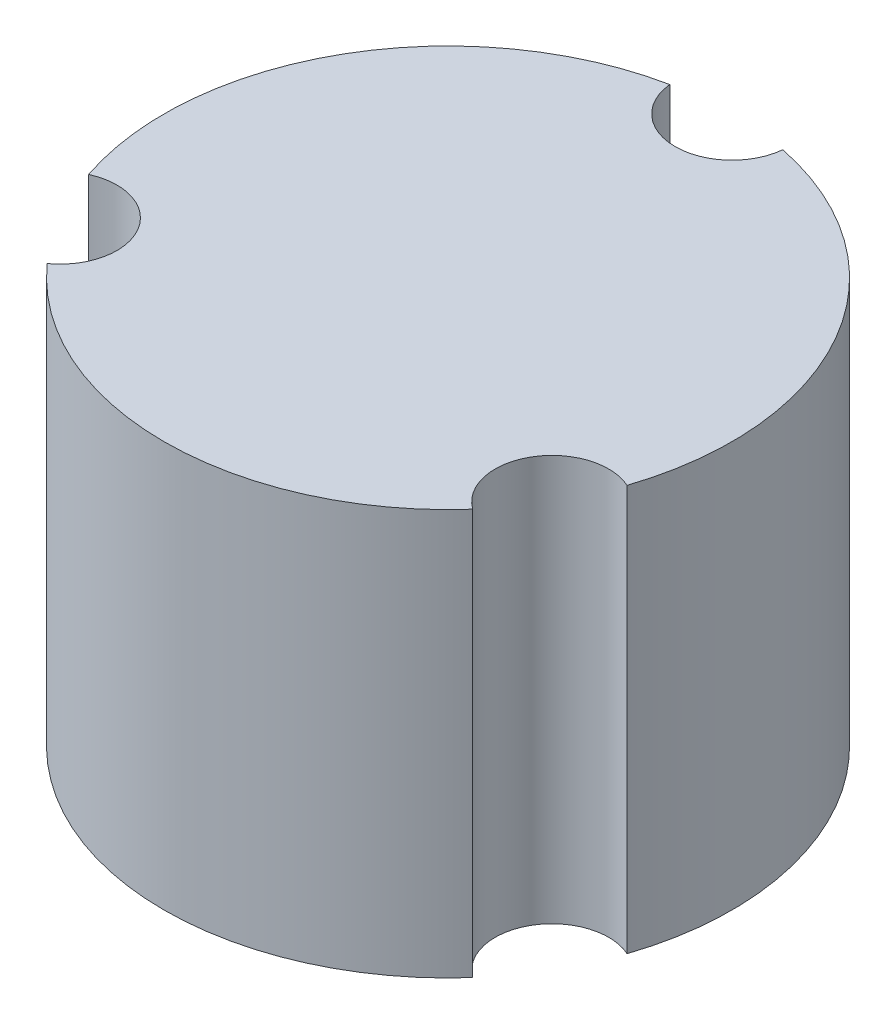
ISO-10303-21;
HEADER;
FILE_DESCRIPTION(('STEP AP214'),'2;1');
FILE_NAME('part.step','',(''),(''),'','','');
FILE_SCHEMA(('AUTOMOTIVE_DESIGN { 1 0 10303 214 1 1 1 1 }'));
ENDSEC;
DATA;
#1=APPLICATION_CONTEXT('core data for automotive mechanical design processes');
#2=APPLICATION_PROTOCOL_DEFINITION('international standard','automotive_design',2000,#1);
#3=PRODUCT_CONTEXT('',#1,'mechanical');
#4=PRODUCT('Part','Part','',(#3));
#5=PRODUCT_RELATED_PRODUCT_CATEGORY('part','',(#4));
#6=PRODUCT_DEFINITION_FORMATION('','',#4);
#7=PRODUCT_DEFINITION_CONTEXT('part definition',#1,'design');
#8=PRODUCT_DEFINITION('design','',#6,#7);
#9=PRODUCT_DEFINITION_SHAPE('','',#8);
#10=(LENGTH_UNIT() NAMED_UNIT(*) SI_UNIT(.MILLI.,.METRE.));
#11=(NAMED_UNIT(*) PLANE_ANGLE_UNIT() SI_UNIT($,.RADIAN.));
#12=(NAMED_UNIT(*) SI_UNIT($,.STERADIAN.) SOLID_ANGLE_UNIT());
#13=UNCERTAINTY_MEASURE_WITH_UNIT(LENGTH_MEASURE(1.E-05),#10,'distance_accuracy_value','');
#14=(GEOMETRIC_REPRESENTATION_CONTEXT(3) GLOBAL_UNCERTAINTY_ASSIGNED_CONTEXT((#13)) GLOBAL_UNIT_ASSIGNED_CONTEXT((#10,
#11,#12)) REPRESENTATION_CONTEXT('',''));
#15=CARTESIAN_POINT('',(0.,0.,0.));
#16=DIRECTION('',(0.,0.,1.));
#17=DIRECTION('',(1.,0.,0.));
#18=AXIS2_PLACEMENT_3D('',#15,#16,#17);
#19=CARTESIAN_POINT('',(0.,31.75,0.));
#20=DIRECTION('',(0.,-1.,0.));
#21=DIRECTION('',(0.,0.,-1.));
#22=AXIS2_PLACEMENT_3D('',#19,#20,#21);
#23=CYLINDRICAL_SURFACE('',#22,22.225);
#24=CARTESIAN_POINT('',(0.,0.,0.));
#25=DIRECTION('',(0.,1.,0.));
#26=DIRECTION('',(0.,0.,1.));
#27=AXIS2_PLACEMENT_3D('',#24,#25,#26);
#28=CIRCLE('',#27,22.225);
#29=CARTESIAN_POINT('',(21.0738258860969,0.,7.0600628554195));
#30=VERTEX_POINT('',#29);
#31=CARTESIAN_POINT('',(4.42271915793893,0.,-21.7805));
#32=VERTEX_POINT('',#31);
#33=EDGE_CURVE('E209',#30,#32,#28,.T.);
#34=ORIENTED_EDGE('',*,*,#33,.T.);
#35=DIRECTION('',(0.,1.,0.));
#36=VECTOR('',#35,1.);
#37=CARTESIAN_POINT('',(4.42271915793892,15.875,-21.7805));
#38=LINE('',#37,#36);
#39=CARTESIAN_POINT('',(4.42271915793892,31.75,-21.7805));
#40=VERTEX_POINT('',#39);
#41=EDGE_CURVE('E202',#32,#40,#38,.T.);
#42=ORIENTED_EDGE('',*,*,#41,.T.);
#43=CARTESIAN_POINT('',(0.,31.75,0.));
#44=DIRECTION('',(0.,1.,0.));
#45=DIRECTION('',(0.,0.,1.));
#46=AXIS2_PLACEMENT_3D('',#43,#44,#45);
#47=CIRCLE('',#46,22.225);
#48=CARTESIAN_POINT('',(21.0738258860969,31.75,7.0600628554195));
#49=VERTEX_POINT('',#48);
#50=EDGE_CURVE('E40',#49,#40,#47,.T.);
#51=ORIENTED_EDGE('',*,*,#50,.F.);
#52=DIRECTION('',(0.,1.,0.));
#53=VECTOR('',#52,1.);
#54=CARTESIAN_POINT('',(21.0738258860969,15.875,7.0600628554195));
#55=LINE('',#54,#53);
#56=EDGE_CURVE('E193',#49,#30,#55,.F.);
#57=ORIENTED_EDGE('',*,*,#56,.T.);
#58=EDGE_LOOP('',(#34,#42,#51,#57));
#59=FACE_BOUND('',#58,.T.);
#60=ADVANCED_FACE('F32',(#59),#23,.T.);
#61=CARTESIAN_POINT('',(-16.6511067281565,0.,14.7204371445804));
#62=VERTEX_POINT('',#61);
#63=CARTESIAN_POINT('',(16.6511067281585,0.,14.7204371445781));
#64=VERTEX_POINT('',#63);
#65=EDGE_CURVE('E205',#62,#64,#28,.T.);
#66=ORIENTED_EDGE('',*,*,#65,.T.);
#67=DIRECTION('',(0.,1.,0.));
#68=VECTOR('',#67,1.);
#69=CARTESIAN_POINT('',(16.6511067281585,15.875,14.7204371445781));
#70=LINE('',#69,#68);
#71=CARTESIAN_POINT('',(16.6511067281585,31.75,14.7204371445781));
#72=VERTEX_POINT('',#71);
#73=EDGE_CURVE('E196',#64,#72,#70,.T.);
#74=ORIENTED_EDGE('',*,*,#73,.T.);
#75=CARTESIAN_POINT('',(-16.6511067281565,31.75,14.7204371445804));
#76=VERTEX_POINT('',#75);
#77=EDGE_CURVE('E206',#76,#72,#47,.T.);
#78=ORIENTED_EDGE('',*,*,#77,.F.);
#79=DIRECTION('',(0.,1.,0.));
#80=VECTOR('',#79,1.);
#81=CARTESIAN_POINT('',(-16.6511067281565,15.875,14.7204371445804));
#82=LINE('',#81,#80);
#83=EDGE_CURVE('E181',#76,#62,#82,.F.);
#84=ORIENTED_EDGE('',*,*,#83,.T.);
#85=EDGE_LOOP('',(#66,#74,#78,#84));
#86=FACE_BOUND('',#85,.T.);
#87=ADVANCED_FACE('F236',(#86),#23,.T.);
#88=CARTESIAN_POINT('',(-4.42271915793892,31.75,-21.7805));
#89=VERTEX_POINT('',#88);
#90=CARTESIAN_POINT('',(-21.073825886096,31.75,7.06006285542204));
#91=VERTEX_POINT('',#90);
#92=EDGE_CURVE('E208',#89,#91,#47,.T.);
#93=ORIENTED_EDGE('',*,*,#92,.F.);
#94=DIRECTION('',(0.,1.,0.));
#95=VECTOR('',#94,1.);
#96=CARTESIAN_POINT('',(-4.42271915793892,15.875,-21.7805));
#97=LINE('',#96,#95);
#98=CARTESIAN_POINT('',(-4.42271915793892,0.,-21.7805));
#99=VERTEX_POINT('',#98);
#100=EDGE_CURVE('E199',#89,#99,#97,.F.);
#101=ORIENTED_EDGE('',*,*,#100,.T.);
#102=CARTESIAN_POINT('',(-21.073825886096,0.,7.06006285542203));
#103=VERTEX_POINT('',#102);
#104=EDGE_CURVE('E211',#99,#103,#28,.T.);
#105=ORIENTED_EDGE('',*,*,#104,.T.);
#106=DIRECTION('',(0.,1.,0.));
#107=VECTOR('',#106,1.);
#108=CARTESIAN_POINT('',(-21.073825886096,15.875,7.06006285542204));
#109=LINE('',#108,#107);
#110=EDGE_CURVE('E55',#103,#91,#109,.T.);
#111=ORIENTED_EDGE('',*,*,#110,.T.);
#112=EDGE_LOOP('',(#93,#101,#105,#111));
#113=FACE_BOUND('',#112,.T.);
#114=ADVANCED_FACE('F34',(#113),#23,.T.);
#115=CARTESIAN_POINT('',(0.,31.75,0.));
#116=DIRECTION('',(0.,1.,0.));
#117=DIRECTION('',(0.,0.,1.));
#118=AXIS2_PLACEMENT_3D('',#115,#116,#117);
#119=PLANE('',#118);
#120=CARTESIAN_POINT('',(0.,31.75,-22.225));
#121=DIRECTION('',(0.,1.,0.));
#122=DIRECTION('',(0.,0.,1.));
#123=AXIS2_PLACEMENT_3D('',#120,#121,#122);
#124=CIRCLE('',#123,4.445);
#125=EDGE_CURVE('E179',#89,#40,#124,.T.);
#126=ORIENTED_EDGE('',*,*,#125,.F.);
#127=ORIENTED_EDGE('',*,*,#92,.T.);
#128=CARTESIAN_POINT('',(-19.2474145991077,31.75,11.1125000000008));
#129=DIRECTION('',(0.,1.,0.));
#130=DIRECTION('',(0.,0.,1.));
#131=AXIS2_PLACEMENT_3D('',#128,#129,#130);
#132=CIRCLE('',#131,4.445);
#133=EDGE_CURVE('E152',#76,#91,#132,.T.);
#134=ORIENTED_EDGE('',*,*,#133,.F.);
#135=ORIENTED_EDGE('',*,*,#77,.T.);
#136=CARTESIAN_POINT('',(19.2474145991106,31.75,11.1124999999992));
#137=DIRECTION('',(0.,1.,0.));
#138=DIRECTION('',(0.,0.,1.));
#139=AXIS2_PLACEMENT_3D('',#136,#137,#138);
#140=CIRCLE('',#139,4.445);
#141=EDGE_CURVE('E185',#49,#72,#140,.T.);
#142=ORIENTED_EDGE('',*,*,#141,.F.);
#143=ORIENTED_EDGE('',*,*,#50,.T.);
#144=EDGE_LOOP('',(#126,#127,#134,#135,#142,#143));
#145=FACE_BOUND('',#144,.T.);
#146=ADVANCED_FACE('F232',(#145),#119,.T.);
#147=CARTESIAN_POINT('',(0.,0.,0.));
#148=DIRECTION('',(0.,1.,0.));
#149=DIRECTION('',(0.,0.,1.));
#150=AXIS2_PLACEMENT_3D('',#147,#148,#149);
#151=PLANE('',#150);
#152=CARTESIAN_POINT('',(0.,0.,-22.225));
#153=DIRECTION('',(0.,1.,0.));
#154=DIRECTION('',(0.,0.,1.));
#155=AXIS2_PLACEMENT_3D('',#152,#153,#154);
#156=CIRCLE('',#155,10.795);
#157=CARTESIAN_POINT('',(-7.17606192490004,0.,-14.1605));
#158=VERTEX_POINT('',#157);
#159=CARTESIAN_POINT('',(7.17606192490004,0.,-14.1605));
#160=VERTEX_POINT('',#159);
#161=EDGE_CURVE('E148',#158,#160,#156,.T.);
#162=ORIENTED_EDGE('',*,*,#161,.F.);
#163=CARTESIAN_POINT('',(0.,0.,0.));
#164=DIRECTION('',(0.,1.,0.));
#165=DIRECTION('',(0.,0.,1.));
#166=AXIS2_PLACEMENT_3D('',#163,#164,#165);
#167=CIRCLE('',#166,15.875);
#168=CARTESIAN_POINT('',(-15.8513836927395,0.,0.86559807390667));
#169=VERTEX_POINT('',#168);
#170=EDGE_CURVE('E172',#158,#169,#167,.T.);
#171=ORIENTED_EDGE('',*,*,#170,.T.);
#172=CARTESIAN_POINT('',(-19.2474145991077,0.,11.1125000000008));
#173=DIRECTION('',(0.,1.,0.));
#174=DIRECTION('',(0.,0.,1.));
#175=AXIS2_PLACEMENT_3D('',#172,#173,#174);
#176=CIRCLE('',#175,10.795);
#177=CARTESIAN_POINT('',(-8.67532176783812,0.,13.2949019260946));
#178=VERTEX_POINT('',#177);
#179=EDGE_CURVE('E141',#178,#169,#176,.T.);
#180=ORIENTED_EDGE('',*,*,#179,.F.);
#181=CARTESIAN_POINT('',(0.,0.,0.));
#182=DIRECTION('',(0.,1.,0.));
#183=DIRECTION('',(0.,0.,1.));
#184=AXIS2_PLACEMENT_3D('',#181,#182,#183);
#185=CIRCLE('',#184,15.875);
#186=CARTESIAN_POINT('',(8.67532176784093,0.,13.2949019260928));
#187=VERTEX_POINT('',#186);
#188=EDGE_CURVE('E47',#178,#187,#185,.T.);
#189=ORIENTED_EDGE('',*,*,#188,.T.);
#190=CARTESIAN_POINT('',(19.2474145991106,0.,11.1124999999992));
#191=DIRECTION('',(0.,1.,0.));
#192=DIRECTION('',(0.,0.,1.));
#193=AXIS2_PLACEMENT_3D('',#190,#191,#192);
#194=CIRCLE('',#193,10.795);
#195=CARTESIAN_POINT('',(15.8513836927396,0.,0.865598073905955));
#196=VERTEX_POINT('',#195);
#197=EDGE_CURVE('E140',#196,#187,#194,.T.);
#198=ORIENTED_EDGE('',*,*,#197,.F.);
#199=CARTESIAN_POINT('',(0.,0.,0.));
#200=DIRECTION('',(0.,1.,0.));
#201=DIRECTION('',(0.,0.,1.));
#202=AXIS2_PLACEMENT_3D('',#199,#200,#201);
#203=CIRCLE('',#202,15.875);
#204=EDGE_CURVE('E127',#196,#160,#203,.T.);
#205=ORIENTED_EDGE('',*,*,#204,.T.);
#206=EDGE_LOOP('',(#162,#171,#180,#189,#198,#205));
#207=FACE_BOUND('',#206,.T.);
#208=ORIENTED_EDGE('',*,*,#104,.F.);
#209=CARTESIAN_POINT('',(0.,0.,-22.225));
#210=DIRECTION('',(0.,1.,0.));
#211=DIRECTION('',(0.,0.,1.));
#212=AXIS2_PLACEMENT_3D('',#209,#210,#211);
#213=CIRCLE('',#212,4.445);
#214=EDGE_CURVE('E11',#99,#32,#213,.T.);
#215=ORIENTED_EDGE('',*,*,#214,.T.);
#216=ORIENTED_EDGE('',*,*,#33,.F.);
#217=CARTESIAN_POINT('',(19.2474145991106,0.,11.1124999999992));
#218=DIRECTION('',(0.,1.,0.));
#219=DIRECTION('',(0.,0.,1.));
#220=AXIS2_PLACEMENT_3D('',#217,#218,#219);
#221=CIRCLE('',#220,4.445);
#222=EDGE_CURVE('E182',#30,#64,#221,.T.);
#223=ORIENTED_EDGE('',*,*,#222,.T.);
#224=ORIENTED_EDGE('',*,*,#65,.F.);
#225=CARTESIAN_POINT('',(-19.2474145991077,0.,11.1125000000008));
#226=DIRECTION('',(0.,1.,0.));
#227=DIRECTION('',(0.,0.,1.));
#228=AXIS2_PLACEMENT_3D('',#225,#226,#227);
#229=CIRCLE('',#228,4.445);
#230=EDGE_CURVE('E187',#62,#103,#229,.T.);
#231=ORIENTED_EDGE('',*,*,#230,.T.);
#232=EDGE_LOOP('',(#208,#215,#216,#223,#224,#231));
#233=FACE_BOUND('',#232,.T.);
#234=ADVANCED_FACE('F222',(#207,#233),#151,.F.);
#235=CARTESIAN_POINT('',(-19.2474145991077,0.,11.1125000000008));
#236=DIRECTION('',(0.,1.,0.));
#237=DIRECTION('',(0.,0.,1.));
#238=AXIS2_PLACEMENT_3D('',#235,#236,#237);
#239=CYLINDRICAL_SURFACE('',#238,4.445);
#240=ORIENTED_EDGE('',*,*,#230,.F.);
#241=ORIENTED_EDGE('',*,*,#83,.F.);
#242=ORIENTED_EDGE('',*,*,#133,.T.);
#243=ORIENTED_EDGE('',*,*,#110,.F.);
#244=EDGE_LOOP('',(#240,#241,#242,#243));
#245=FACE_BOUND('',#244,.T.);
#246=ADVANCED_FACE('F237',(#245),#239,.F.);
#247=CARTESIAN_POINT('',(19.2474145991106,0.,11.1124999999992));
#248=DIRECTION('',(0.,1.,0.));
#249=DIRECTION('',(0.,0.,1.));
#250=AXIS2_PLACEMENT_3D('',#247,#248,#249);
#251=CYLINDRICAL_SURFACE('',#250,4.445);
#252=ORIENTED_EDGE('',*,*,#222,.F.);
#253=ORIENTED_EDGE('',*,*,#56,.F.);
#254=ORIENTED_EDGE('',*,*,#141,.T.);
#255=ORIENTED_EDGE('',*,*,#73,.F.);
#256=EDGE_LOOP('',(#252,#253,#254,#255));
#257=FACE_BOUND('',#256,.T.);
#258=ADVANCED_FACE('F235',(#257),#251,.F.);
#259=CARTESIAN_POINT('',(0.,0.,-22.225));
#260=DIRECTION('',(0.,1.,0.));
#261=DIRECTION('',(0.,0.,1.));
#262=AXIS2_PLACEMENT_3D('',#259,#260,#261);
#263=CYLINDRICAL_SURFACE('',#262,4.445);
#264=ORIENTED_EDGE('',*,*,#214,.F.);
#265=ORIENTED_EDGE('',*,*,#100,.F.);
#266=ORIENTED_EDGE('',*,*,#125,.T.);
#267=ORIENTED_EDGE('',*,*,#41,.F.);
#268=EDGE_LOOP('',(#264,#265,#266,#267));
#269=FACE_BOUND('',#268,.T.);
#270=ADVANCED_FACE('F224',(#269),#263,.F.);
#271=CARTESIAN_POINT('',(0.,31.75,0.));
#272=DIRECTION('',(0.,-1.,0.));
#273=DIRECTION('',(0.,0.,-1.));
#274=AXIS2_PLACEMENT_3D('',#271,#272,#273);
#275=CYLINDRICAL_SURFACE('',#274,15.875);
#276=ORIENTED_EDGE('',*,*,#204,.F.);
#277=DIRECTION('',(0.,1.,0.));
#278=VECTOR('',#277,1.);
#279=CARTESIAN_POINT('',(15.8513836927396,25.4,0.865598073905955));
#280=LINE('',#279,#278);
#281=CARTESIAN_POINT('',(15.8513836927396,25.4,0.865598073905955));
#282=VERTEX_POINT('',#281);
#283=EDGE_CURVE('E121',#282,#196,#280,.F.);
#284=ORIENTED_EDGE('',*,*,#283,.F.);
#285=CARTESIAN_POINT('',(0.,25.4,0.));
#286=DIRECTION('',(0.,1.,0.));
#287=DIRECTION('',(0.,0.,1.));
#288=AXIS2_PLACEMENT_3D('',#285,#286,#287);
#289=CIRCLE('',#288,15.875);
#290=CARTESIAN_POINT('',(7.17606192490004,25.4,-14.1605));
#291=VERTEX_POINT('',#290);
#292=EDGE_CURVE('E125',#282,#291,#289,.T.);
#293=ORIENTED_EDGE('',*,*,#292,.T.);
#294=DIRECTION('',(0.,1.,0.));
#295=VECTOR('',#294,1.);
#296=CARTESIAN_POINT('',(7.17606192490004,0.,-14.1605));
#297=LINE('',#296,#295);
#298=EDGE_CURVE('E158',#160,#291,#297,.T.);
#299=ORIENTED_EDGE('',*,*,#298,.F.);
#300=EDGE_LOOP('',(#276,#284,#293,#299));
#301=FACE_BOUND('',#300,.T.);
#302=ADVANCED_FACE('F123',(#301),#275,.F.);
#303=ORIENTED_EDGE('',*,*,#188,.F.);
#304=DIRECTION('',(0.,1.,0.));
#305=VECTOR('',#304,1.);
#306=CARTESIAN_POINT('',(-8.67532176783812,25.4,13.2949019260946));
#307=LINE('',#306,#305);
#308=CARTESIAN_POINT('',(-8.67532176783812,25.4,13.2949019260946));
#309=VERTEX_POINT('',#308);
#310=EDGE_CURVE('E160',#309,#178,#307,.F.);
#311=ORIENTED_EDGE('',*,*,#310,.F.);
#312=CARTESIAN_POINT('',(0.,25.4,0.));
#313=DIRECTION('',(0.,1.,0.));
#314=DIRECTION('',(0.,0.,1.));
#315=AXIS2_PLACEMENT_3D('',#312,#313,#314);
#316=CIRCLE('',#315,15.875);
#317=CARTESIAN_POINT('',(8.67532176784093,25.4,13.2949019260928));
#318=VERTEX_POINT('',#317);
#319=EDGE_CURVE('E155',#309,#318,#316,.T.);
#320=ORIENTED_EDGE('',*,*,#319,.T.);
#321=DIRECTION('',(0.,1.,0.));
#322=VECTOR('',#321,1.);
#323=CARTESIAN_POINT('',(8.67532176784093,0.,13.2949019260928));
#324=LINE('',#323,#322);
#325=EDGE_CURVE('E131',#187,#318,#324,.T.);
#326=ORIENTED_EDGE('',*,*,#325,.F.);
#327=EDGE_LOOP('',(#303,#311,#320,#326));
#328=FACE_BOUND('',#327,.T.);
#329=ADVANCED_FACE('F276',(#328),#275,.F.);
#330=CARTESIAN_POINT('',(0.,25.4,0.));
#331=DIRECTION('',(0.,1.,0.));
#332=DIRECTION('',(0.,0.,1.));
#333=AXIS2_PLACEMENT_3D('',#330,#331,#332);
#334=CIRCLE('',#333,15.875);
#335=CARTESIAN_POINT('',(-7.17606192490004,25.4,-14.1605));
#336=VERTEX_POINT('',#335);
#337=CARTESIAN_POINT('',(-15.8513836927395,25.4,0.86559807390667));
#338=VERTEX_POINT('',#337);
#339=EDGE_CURVE('E149',#336,#338,#334,.T.);
#340=ORIENTED_EDGE('',*,*,#339,.T.);
#341=DIRECTION('',(0.,1.,0.));
#342=VECTOR('',#341,1.);
#343=CARTESIAN_POINT('',(-15.8513836927395,0.,0.86559807390667));
#344=LINE('',#343,#342);
#345=EDGE_CURVE('E132',#169,#338,#344,.T.);
#346=ORIENTED_EDGE('',*,*,#345,.F.);
#347=ORIENTED_EDGE('',*,*,#170,.F.);
#348=DIRECTION('',(0.,1.,0.));
#349=VECTOR('',#348,1.);
#350=CARTESIAN_POINT('',(-7.17606192490004,25.4,-14.1605));
#351=LINE('',#350,#349);
#352=EDGE_CURVE('E166',#336,#158,#351,.F.);
#353=ORIENTED_EDGE('',*,*,#352,.F.);
#354=EDGE_LOOP('',(#340,#346,#347,#353));
#355=FACE_BOUND('',#354,.T.);
#356=ADVANCED_FACE('F278',(#355),#275,.F.);
#357=CARTESIAN_POINT('',(0.,25.4,0.));
#358=DIRECTION('',(0.,1.,0.));
#359=DIRECTION('',(0.,0.,1.));
#360=AXIS2_PLACEMENT_3D('',#357,#358,#359);
#361=PLANE('',#360);
#362=CARTESIAN_POINT('',(0.,25.4,-22.225));
#363=DIRECTION('',(0.,1.,0.));
#364=DIRECTION('',(0.,0.,1.));
#365=AXIS2_PLACEMENT_3D('',#362,#363,#364);
#366=CIRCLE('',#365,10.795);
#367=EDGE_CURVE('E146',#336,#291,#366,.T.);
#368=ORIENTED_EDGE('',*,*,#367,.T.);
#369=ORIENTED_EDGE('',*,*,#292,.F.);
#370=CARTESIAN_POINT('',(19.2474145991106,25.4,11.1124999999992));
#371=DIRECTION('',(0.,1.,0.));
#372=DIRECTION('',(0.,0.,1.));
#373=AXIS2_PLACEMENT_3D('',#370,#371,#372);
#374=CIRCLE('',#373,10.795);
#375=EDGE_CURVE('E135',#282,#318,#374,.T.);
#376=ORIENTED_EDGE('',*,*,#375,.T.);
#377=ORIENTED_EDGE('',*,*,#319,.F.);
#378=CARTESIAN_POINT('',(-19.2474145991077,25.4,11.1125000000008));
#379=DIRECTION('',(0.,1.,0.));
#380=DIRECTION('',(0.,0.,1.));
#381=AXIS2_PLACEMENT_3D('',#378,#379,#380);
#382=CIRCLE('',#381,10.795);
#383=EDGE_CURVE('E162',#309,#338,#382,.T.);
#384=ORIENTED_EDGE('',*,*,#383,.T.);
#385=ORIENTED_EDGE('',*,*,#339,.F.);
#386=EDGE_LOOP('',(#368,#369,#376,#377,#384,#385));
#387=FACE_BOUND('',#386,.T.);
#388=ADVANCED_FACE('F143',(#387),#361,.F.);
#389=CARTESIAN_POINT('',(-19.2474145991077,0.,11.1125000000008));
#390=DIRECTION('',(0.,1.,0.));
#391=DIRECTION('',(0.,0.,1.));
#392=AXIS2_PLACEMENT_3D('',#389,#390,#391);
#393=CYLINDRICAL_SURFACE('',#392,10.795);
#394=ORIENTED_EDGE('',*,*,#179,.T.);
#395=ORIENTED_EDGE('',*,*,#345,.T.);
#396=ORIENTED_EDGE('',*,*,#383,.F.);
#397=ORIENTED_EDGE('',*,*,#310,.T.);
#398=EDGE_LOOP('',(#394,#395,#396,#397));
#399=FACE_BOUND('',#398,.T.);
#400=ADVANCED_FACE('F301',(#399),#393,.T.);
#401=CARTESIAN_POINT('',(19.2474145991106,0.,11.1124999999992));
#402=DIRECTION('',(0.,1.,0.));
#403=DIRECTION('',(0.,0.,1.));
#404=AXIS2_PLACEMENT_3D('',#401,#402,#403);
#405=CYLINDRICAL_SURFACE('',#404,10.795);
#406=ORIENTED_EDGE('',*,*,#197,.T.);
#407=ORIENTED_EDGE('',*,*,#325,.T.);
#408=ORIENTED_EDGE('',*,*,#375,.F.);
#409=ORIENTED_EDGE('',*,*,#283,.T.);
#410=EDGE_LOOP('',(#406,#407,#408,#409));
#411=FACE_BOUND('',#410,.T.);
#412=ADVANCED_FACE('F136',(#411),#405,.T.);
#413=CARTESIAN_POINT('',(0.,0.,-22.225));
#414=DIRECTION('',(0.,1.,0.));
#415=DIRECTION('',(0.,0.,1.));
#416=AXIS2_PLACEMENT_3D('',#413,#414,#415);
#417=CYLINDRICAL_SURFACE('',#416,10.795);
#418=ORIENTED_EDGE('',*,*,#161,.T.);
#419=ORIENTED_EDGE('',*,*,#298,.T.);
#420=ORIENTED_EDGE('',*,*,#367,.F.);
#421=ORIENTED_EDGE('',*,*,#352,.T.);
#422=EDGE_LOOP('',(#418,#419,#420,#421));
#423=FACE_BOUND('',#422,.T.);
#424=ADVANCED_FACE('F319',(#423),#417,.T.);
#425=CLOSED_SHELL('',(#60,#87,#114,#146,#234,#246,#258,#270,#302,#329,#356,#388,#400,#412,#424));
#426=MANIFOLD_SOLID_BREP('B2',#425);
#427=ADVANCED_BREP_SHAPE_REPRESENTATION('',(#18,#426),#14);
#428=SHAPE_DEFINITION_REPRESENTATION(#9,#427);
ENDSEC;
END-ISO-10303-21;
